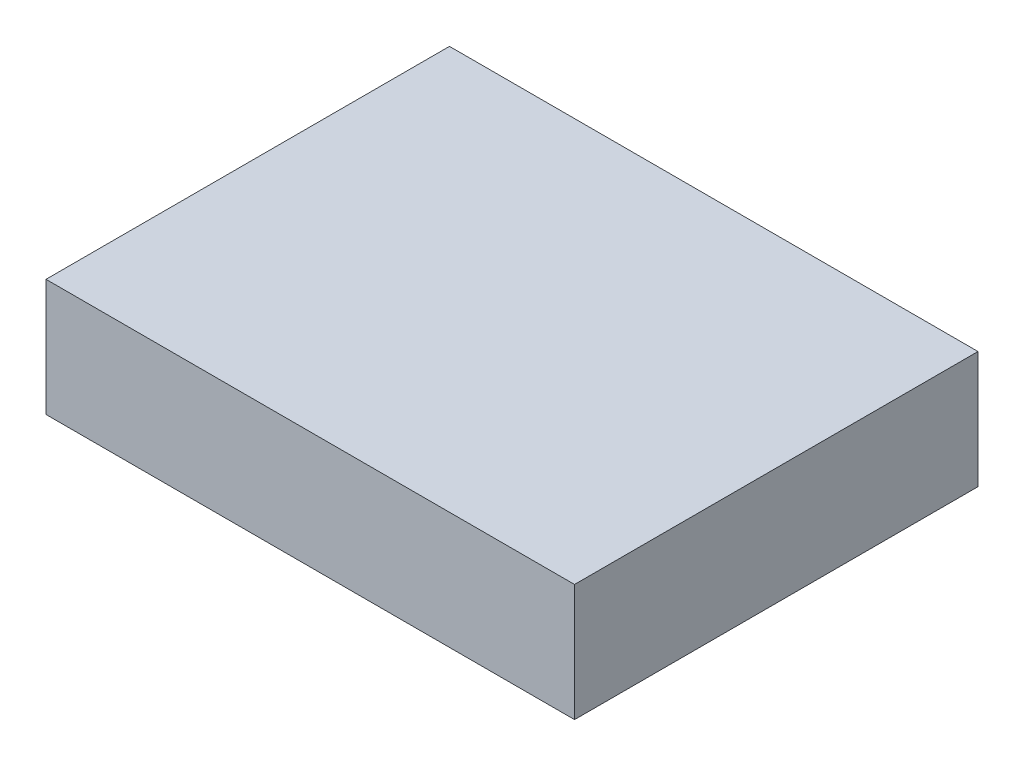
ISO-10303-21;
HEADER;
FILE_DESCRIPTION(('STEP AP214'),'2;1');
FILE_NAME('part.step','',(''),(''),'','','');
FILE_SCHEMA(('AUTOMOTIVE_DESIGN { 1 0 10303 214 1 1 1 1 }'));
ENDSEC;
DATA;
#1=APPLICATION_CONTEXT('core data for automotive mechanical design processes');
#2=APPLICATION_PROTOCOL_DEFINITION('international standard','automotive_design',2000,#1);
#3=PRODUCT_CONTEXT('',#1,'mechanical');
#4=PRODUCT('Part','Part','',(#3));
#5=PRODUCT_RELATED_PRODUCT_CATEGORY('part','',(#4));
#6=PRODUCT_DEFINITION_FORMATION('','',#4);
#7=PRODUCT_DEFINITION_CONTEXT('part definition',#1,'design');
#8=PRODUCT_DEFINITION('design','',#6,#7);
#9=PRODUCT_DEFINITION_SHAPE('','',#8);
#10=(LENGTH_UNIT() NAMED_UNIT(*) SI_UNIT(.MILLI.,.METRE.));
#11=(NAMED_UNIT(*) PLANE_ANGLE_UNIT() SI_UNIT($,.RADIAN.));
#12=(NAMED_UNIT(*) SI_UNIT($,.STERADIAN.) SOLID_ANGLE_UNIT());
#13=UNCERTAINTY_MEASURE_WITH_UNIT(LENGTH_MEASURE(1.E-05),#10,'distance_accuracy_value','');
#14=(GEOMETRIC_REPRESENTATION_CONTEXT(3) GLOBAL_UNCERTAINTY_ASSIGNED_CONTEXT((#13)) GLOBAL_UNIT_ASSIGNED_CONTEXT((#10,
#11,#12)) REPRESENTATION_CONTEXT('',''));
#15=CARTESIAN_POINT('',(0.,0.,0.));
#16=DIRECTION('',(0.,0.,1.));
#17=DIRECTION('',(1.,0.,0.));
#18=AXIS2_PLACEMENT_3D('',#15,#16,#17);
#19=CARTESIAN_POINT('',(0.,-150.,0.));
#20=DIRECTION('',(0.,-1.,0.));
#21=DIRECTION('',(0.,0.,-1.));
#22=AXIS2_PLACEMENT_3D('',#19,#20,#21);
#23=PLANE('',#22);
#24=DIRECTION('',(0.,0.,-1.));
#25=VECTOR('',#24,1.);
#26=CARTESIAN_POINT('',(-111.585836478848,-150.,86.1531671959199));
#27=LINE('',#26,#25);
#28=CARTESIAN_POINT('',(-111.585836478848,-150.,86.1531671959199));
#29=VERTEX_POINT('',#28);
#30=CARTESIAN_POINT('',(-111.585836478848,-150.,-86.1531671959199));
#31=VERTEX_POINT('',#30);
#32=EDGE_CURVE('E81',#29,#31,#27,.T.);
#33=ORIENTED_EDGE('',*,*,#32,.T.);
#34=DIRECTION('',(1.,0.,0.));
#35=VECTOR('',#34,1.);
#36=CARTESIAN_POINT('',(-111.585836478848,-150.,-86.1531671959199));
#37=LINE('',#36,#35);
#38=CARTESIAN_POINT('',(114.129103407141,-150.,-86.1531671959199));
#39=VERTEX_POINT('',#38);
#40=EDGE_CURVE('E88',#31,#39,#37,.T.);
#41=ORIENTED_EDGE('',*,*,#40,.T.);
#42=DIRECTION('',(0.,0.,1.));
#43=VECTOR('',#42,1.);
#44=CARTESIAN_POINT('',(114.129103407141,-150.,86.1531671959199));
#45=LINE('',#44,#43);
#46=CARTESIAN_POINT('',(114.129103407141,-150.,86.1531671959199));
#47=VERTEX_POINT('',#46);
#48=EDGE_CURVE('E94',#39,#47,#45,.T.);
#49=ORIENTED_EDGE('',*,*,#48,.T.);
#50=DIRECTION('',(-1.,0.,0.));
#51=VECTOR('',#50,1.);
#52=CARTESIAN_POINT('',(-111.585836478848,-150.,86.1531671959199));
#53=LINE('',#52,#51);
#54=EDGE_CURVE('E86',#47,#29,#53,.T.);
#55=ORIENTED_EDGE('',*,*,#54,.T.);
#56=EDGE_LOOP('',(#33,#41,#49,#55));
#57=FACE_BOUND('',#56,.T.);
#58=ADVANCED_FACE('F39',(#57),#23,.T.);
#59=CARTESIAN_POINT('',(-111.585836478848,-50.,-86.1531671959199));
#60=DIRECTION('',(0.,0.,-1.));
#61=DIRECTION('',(-1.,0.,0.));
#62=AXIS2_PLACEMENT_3D('',#59,#60,#61);
#63=PLANE('',#62);
#64=DIRECTION('',(0.,-1.,0.));
#65=VECTOR('',#64,1.);
#66=CARTESIAN_POINT('',(-111.585836478848,-50.,-86.1531671959199));
#67=LINE('',#66,#65);
#68=CARTESIAN_POINT('',(-111.585836478848,-100.,-86.1531671959199));
#69=VERTEX_POINT('',#68);
#70=EDGE_CURVE('E77',#69,#31,#67,.T.);
#71=ORIENTED_EDGE('',*,*,#70,.F.);
#72=DIRECTION('',(1.,0.,0.));
#73=VECTOR('',#72,1.);
#74=CARTESIAN_POINT('',(-111.585836478848,-100.,-86.1531671959199));
#75=LINE('',#74,#73);
#76=CARTESIAN_POINT('',(114.129103407141,-100.,-86.1531671959199));
#77=VERTEX_POINT('',#76);
#78=EDGE_CURVE('E43',#69,#77,#75,.T.);
#79=ORIENTED_EDGE('',*,*,#78,.T.);
#80=DIRECTION('',(0.,-1.,0.));
#81=VECTOR('',#80,1.);
#82=CARTESIAN_POINT('',(114.129103407141,-50.,-86.1531671959199));
#83=LINE('',#82,#81);
#84=EDGE_CURVE('E85',#77,#39,#83,.T.);
#85=ORIENTED_EDGE('',*,*,#84,.T.);
#86=ORIENTED_EDGE('',*,*,#40,.F.);
#87=EDGE_LOOP('',(#71,#79,#85,#86));
#88=FACE_BOUND('',#87,.T.);
#89=ADVANCED_FACE('F89',(#88),#63,.T.);
#90=CARTESIAN_POINT('',(114.129103407141,-50.,86.1531671959199));
#91=DIRECTION('',(1.,0.,0.));
#92=DIRECTION('',(0.,0.,-1.));
#93=AXIS2_PLACEMENT_3D('',#90,#91,#92);
#94=PLANE('',#93);
#95=ORIENTED_EDGE('',*,*,#84,.F.);
#96=DIRECTION('',(0.,0.,1.));
#97=VECTOR('',#96,1.);
#98=CARTESIAN_POINT('',(114.129103407141,-100.,86.1531671959199));
#99=LINE('',#98,#97);
#100=CARTESIAN_POINT('',(114.129103407141,-100.,86.1531671959199));
#101=VERTEX_POINT('',#100);
#102=EDGE_CURVE('E109',#77,#101,#99,.T.);
#103=ORIENTED_EDGE('',*,*,#102,.T.);
#104=DIRECTION('',(0.,-1.,0.));
#105=VECTOR('',#104,1.);
#106=CARTESIAN_POINT('',(114.129103407141,-50.,86.1531671959199));
#107=LINE('',#106,#105);
#108=EDGE_CURVE('E104',#101,#47,#107,.T.);
#109=ORIENTED_EDGE('',*,*,#108,.T.);
#110=ORIENTED_EDGE('',*,*,#48,.F.);
#111=EDGE_LOOP('',(#95,#103,#109,#110));
#112=FACE_BOUND('',#111,.T.);
#113=ADVANCED_FACE('F108',(#112),#94,.T.);
#114=CARTESIAN_POINT('',(-111.585836478848,-50.,86.1531671959199));
#115=DIRECTION('',(0.,0.,1.));
#116=DIRECTION('',(1.,0.,0.));
#117=AXIS2_PLACEMENT_3D('',#114,#115,#116);
#118=PLANE('',#117);
#119=ORIENTED_EDGE('',*,*,#108,.F.);
#120=DIRECTION('',(-1.,0.,0.));
#121=VECTOR('',#120,1.);
#122=CARTESIAN_POINT('',(-111.585836478848,-100.,86.1531671959199));
#123=LINE('',#122,#121);
#124=CARTESIAN_POINT('',(-111.585836478848,-100.,86.1531671959199));
#125=VERTEX_POINT('',#124);
#126=EDGE_CURVE('E49',#101,#125,#123,.T.);
#127=ORIENTED_EDGE('',*,*,#126,.T.);
#128=DIRECTION('',(0.,-1.,0.));
#129=VECTOR('',#128,1.);
#130=CARTESIAN_POINT('',(-111.585836478848,-50.,86.1531671959199));
#131=LINE('',#130,#129);
#132=EDGE_CURVE('E102',#125,#29,#131,.T.);
#133=ORIENTED_EDGE('',*,*,#132,.T.);
#134=ORIENTED_EDGE('',*,*,#54,.F.);
#135=EDGE_LOOP('',(#119,#127,#133,#134));
#136=FACE_BOUND('',#135,.T.);
#137=ADVANCED_FACE('F111',(#136),#118,.T.);
#138=CARTESIAN_POINT('',(-111.585836478848,-50.,86.1531671959199));
#139=DIRECTION('',(-1.,0.,0.));
#140=DIRECTION('',(0.,0.,1.));
#141=AXIS2_PLACEMENT_3D('',#138,#139,#140);
#142=PLANE('',#141);
#143=ORIENTED_EDGE('',*,*,#132,.F.);
#144=DIRECTION('',(0.,0.,-1.));
#145=VECTOR('',#144,1.);
#146=CARTESIAN_POINT('',(-111.585836478848,-100.,86.1531671959199));
#147=LINE('',#146,#145);
#148=EDGE_CURVE('E11',#125,#69,#147,.T.);
#149=ORIENTED_EDGE('',*,*,#148,.T.);
#150=ORIENTED_EDGE('',*,*,#70,.T.);
#151=ORIENTED_EDGE('',*,*,#32,.F.);
#152=EDGE_LOOP('',(#143,#149,#150,#151));
#153=FACE_BOUND('',#152,.T.);
#154=ADVANCED_FACE('F41',(#153),#142,.T.);
#155=CARTESIAN_POINT('',(0.,-100.,0.));
#156=DIRECTION('',(0.,-1.,0.));
#157=DIRECTION('',(0.,0.,-1.));
#158=AXIS2_PLACEMENT_3D('',#155,#156,#157);
#159=PLANE('',#158);
#160=ORIENTED_EDGE('',*,*,#126,.F.);
#161=ORIENTED_EDGE('',*,*,#102,.F.);
#162=ORIENTED_EDGE('',*,*,#78,.F.);
#163=ORIENTED_EDGE('',*,*,#148,.F.);
#164=EDGE_LOOP('',(#160,#161,#162,#163));
#165=FACE_BOUND('',#164,.T.);
#166=ADVANCED_FACE('F113',(#165),#159,.F.);
#167=CLOSED_SHELL('',(#58,#89,#113,#137,#154,#166));
#168=MANIFOLD_SOLID_BREP('B2',#167);
#169=ADVANCED_BREP_SHAPE_REPRESENTATION('',(#18,#168),#14);
#170=SHAPE_DEFINITION_REPRESENTATION(#9,#169);
ENDSEC;
END-ISO-10303-21;
